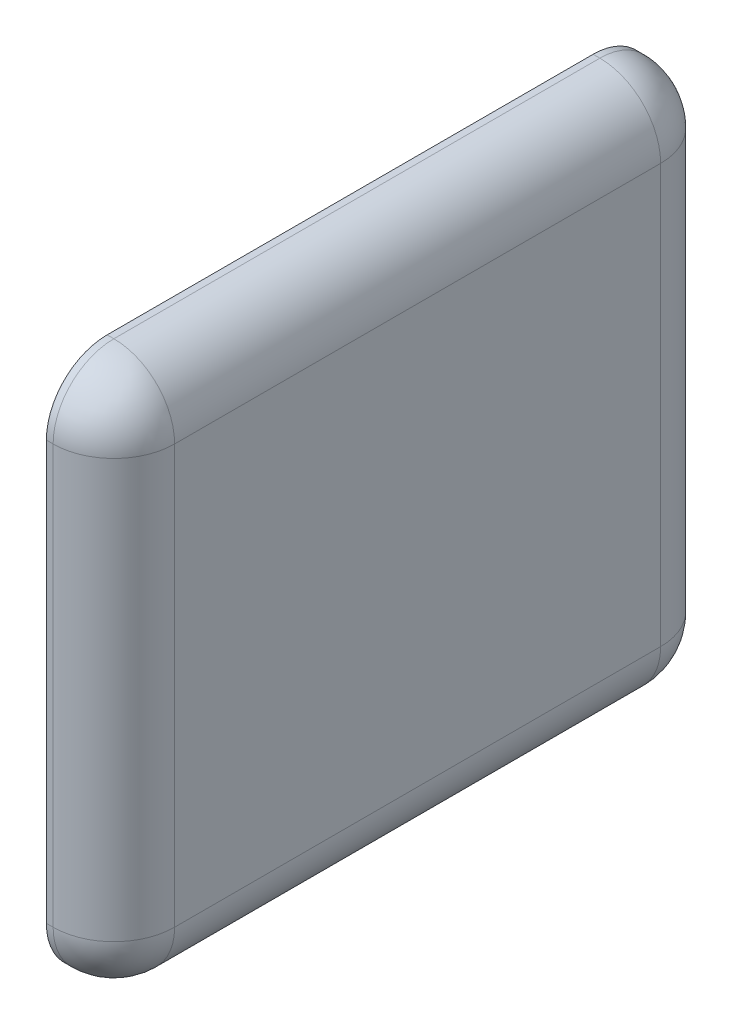
ISO-10303-21;
HEADER;
FILE_DESCRIPTION(('STEP AP214'),'2;1');
FILE_NAME('part.step','',(''),(''),'','','');
FILE_SCHEMA(('AUTOMOTIVE_DESIGN { 1 0 10303 214 1 1 1 1 }'));
ENDSEC;
DATA;
#1=APPLICATION_CONTEXT('core data for automotive mechanical design processes');
#2=APPLICATION_PROTOCOL_DEFINITION('international standard','automotive_design',2000,#1);
#3=PRODUCT_CONTEXT('',#1,'mechanical');
#4=PRODUCT('Part','Part','',(#3));
#5=PRODUCT_RELATED_PRODUCT_CATEGORY('part','',(#4));
#6=PRODUCT_DEFINITION_FORMATION('','',#4);
#7=PRODUCT_DEFINITION_CONTEXT('part definition',#1,'design');
#8=PRODUCT_DEFINITION('design','',#6,#7);
#9=PRODUCT_DEFINITION_SHAPE('','',#8);
#10=(LENGTH_UNIT() NAMED_UNIT(*) SI_UNIT(.MILLI.,.METRE.));
#11=(NAMED_UNIT(*) PLANE_ANGLE_UNIT() SI_UNIT($,.RADIAN.));
#12=(NAMED_UNIT(*) SI_UNIT($,.STERADIAN.) SOLID_ANGLE_UNIT());
#13=UNCERTAINTY_MEASURE_WITH_UNIT(LENGTH_MEASURE(1.E-05),#10,'distance_accuracy_value','');
#14=(GEOMETRIC_REPRESENTATION_CONTEXT(3) GLOBAL_UNCERTAINTY_ASSIGNED_CONTEXT((#13)) GLOBAL_UNIT_ASSIGNED_CONTEXT((#10,
#11,#12)) REPRESENTATION_CONTEXT('',''));
#15=CARTESIAN_POINT('',(0.,0.,0.));
#16=DIRECTION('',(0.,0.,1.));
#17=DIRECTION('',(1.,0.,0.));
#18=AXIS2_PLACEMENT_3D('',#15,#16,#17);
#19=CARTESIAN_POINT('',(1.4,-0.8,0.));
#20=DIRECTION('',(1.,0.,0.));
#21=DIRECTION('',(0.,0.,1.));
#22=AXIS2_PLACEMENT_3D('',#19,#20,#21);
#23=PLANE('',#22);
#24=CARTESIAN_POINT('',(1.4,-0.62,1.62));
#25=DIRECTION('',(-1.,0.,0.));
#26=DIRECTION('',(0.,-1.,0.));
#27=AXIS2_PLACEMENT_3D('',#24,#25,#26);
#28=CIRCLE('',#27,0.18);
#29=CARTESIAN_POINT('',(1.4,-0.8,1.62));
#30=VERTEX_POINT('',#29);
#31=CARTESIAN_POINT('',(1.4,-0.62,1.8));
#32=VERTEX_POINT('',#31);
#33=EDGE_CURVE('E11',#30,#32,#28,.T.);
#34=ORIENTED_EDGE('',*,*,#33,.T.);
#35=DIRECTION('',(0.,1.,0.));
#36=VECTOR('',#35,1.);
#37=CARTESIAN_POINT('',(1.4,-0.62,1.8));
#38=LINE('',#37,#36);
#39=CARTESIAN_POINT('',(1.4,0.62,1.8));
#40=VERTEX_POINT('',#39);
#41=EDGE_CURVE('E193',#32,#40,#38,.T.);
#42=ORIENTED_EDGE('',*,*,#41,.T.);
#43=CARTESIAN_POINT('',(1.4,0.62,1.62));
#44=DIRECTION('',(1.,0.,0.));
#45=DIRECTION('',(0.,1.,0.));
#46=AXIS2_PLACEMENT_3D('',#43,#44,#45);
#47=CIRCLE('',#46,0.18);
#48=CARTESIAN_POINT('',(1.4,0.8,1.62));
#49=VERTEX_POINT('',#48);
#50=EDGE_CURVE('E186',#49,#40,#47,.T.);
#51=ORIENTED_EDGE('',*,*,#50,.F.);
#52=DIRECTION('',(0.,0.,1.));
#53=VECTOR('',#52,1.);
#54=CARTESIAN_POINT('',(1.4,0.8,0.18));
#55=LINE('',#54,#53);
#56=CARTESIAN_POINT('',(1.4,0.8,0.18));
#57=VERTEX_POINT('',#56);
#58=EDGE_CURVE('E178',#57,#49,#55,.T.);
#59=ORIENTED_EDGE('',*,*,#58,.F.);
#60=CARTESIAN_POINT('',(1.4,0.62,0.18));
#61=DIRECTION('',(-1.,0.,0.));
#62=DIRECTION('',(0.,1.,0.));
#63=AXIS2_PLACEMENT_3D('',#60,#61,#62);
#64=CIRCLE('',#63,0.18);
#65=CARTESIAN_POINT('',(1.4,0.62,0.));
#66=VERTEX_POINT('',#65);
#67=EDGE_CURVE('E167',#57,#66,#64,.T.);
#68=ORIENTED_EDGE('',*,*,#67,.T.);
#69=DIRECTION('',(0.,1.,0.));
#70=VECTOR('',#69,1.);
#71=CARTESIAN_POINT('',(1.4,-0.62,0.));
#72=LINE('',#71,#70);
#73=CARTESIAN_POINT('',(1.4,-0.62,0.));
#74=VERTEX_POINT('',#73);
#75=EDGE_CURVE('E160',#74,#66,#72,.T.);
#76=ORIENTED_EDGE('',*,*,#75,.F.);
#77=CARTESIAN_POINT('',(1.4,-0.62,0.18));
#78=DIRECTION('',(1.,0.,0.));
#79=DIRECTION('',(0.,-1.,0.));
#80=AXIS2_PLACEMENT_3D('',#77,#78,#79);
#81=CIRCLE('',#80,0.18);
#82=CARTESIAN_POINT('',(1.4,-0.8,0.18));
#83=VERTEX_POINT('',#82);
#84=EDGE_CURVE('E191',#83,#74,#81,.T.);
#85=ORIENTED_EDGE('',*,*,#84,.F.);
#86=DIRECTION('',(0.,0.,1.));
#87=VECTOR('',#86,1.);
#88=CARTESIAN_POINT('',(1.4,-0.8,0.18));
#89=LINE('',#88,#87);
#90=EDGE_CURVE('E169',#83,#30,#89,.T.);
#91=ORIENTED_EDGE('',*,*,#90,.T.);
#92=EDGE_LOOP('',(#34,#42,#51,#59,#68,#76,#85,#91));
#93=FACE_BOUND('',#92,.T.);
#94=ADVANCED_FACE('F17',(#93),#23,.F.);
#95=CARTESIAN_POINT('',(1.4,-0.8,0.));
#96=DIRECTION('',(0.,1.,0.));
#97=DIRECTION('',(0.,0.,1.));
#98=AXIS2_PLACEMENT_3D('',#95,#96,#97);
#99=PLANE('',#98);
#100=DIRECTION('',(1.,0.,0.));
#101=VECTOR('',#100,1.);
#102=CARTESIAN_POINT('',(1.4,-0.8,0.18));
#103=LINE('',#102,#101);
#104=CARTESIAN_POINT('',(1.42,-0.8,0.18));
#105=VERTEX_POINT('',#104);
#106=EDGE_CURVE('E24',#83,#105,#103,.T.);
#107=ORIENTED_EDGE('',*,*,#106,.T.);
#108=DIRECTION('',(0.,0.,1.));
#109=VECTOR('',#108,1.);
#110=CARTESIAN_POINT('',(1.42,-0.8,0.18));
#111=LINE('',#110,#109);
#112=CARTESIAN_POINT('',(1.42,-0.8,1.62));
#113=VERTEX_POINT('',#112);
#114=EDGE_CURVE('E189',#105,#113,#111,.T.);
#115=ORIENTED_EDGE('',*,*,#114,.T.);
#116=DIRECTION('',(1.,0.,0.));
#117=VECTOR('',#116,1.);
#118=CARTESIAN_POINT('',(1.4,-0.8,1.62));
#119=LINE('',#118,#117);
#120=EDGE_CURVE('E183',#30,#113,#119,.T.);
#121=ORIENTED_EDGE('',*,*,#120,.F.);
#122=ORIENTED_EDGE('',*,*,#90,.F.);
#123=EDGE_LOOP('',(#107,#115,#121,#122));
#124=FACE_BOUND('',#123,.T.);
#125=ADVANCED_FACE('F231',(#124),#99,.F.);
#126=CARTESIAN_POINT('',(1.4,-0.62,0.18));
#127=DIRECTION('',(1.,0.,0.));
#128=DIRECTION('',(0.,-1.,0.));
#129=AXIS2_PLACEMENT_3D('',#126,#127,#128);
#130=CYLINDRICAL_SURFACE('',#129,0.18);
#131=ORIENTED_EDGE('',*,*,#84,.T.);
#132=DIRECTION('',(1.,0.,0.));
#133=VECTOR('',#132,1.);
#134=CARTESIAN_POINT('',(1.4,-0.62,0.));
#135=LINE('',#134,#133);
#136=CARTESIAN_POINT('',(1.42,-0.62,0.));
#137=VERTEX_POINT('',#136);
#138=EDGE_CURVE('E181',#74,#137,#135,.T.);
#139=ORIENTED_EDGE('',*,*,#138,.T.);
#140=CARTESIAN_POINT('',(1.42,-0.62,0.18));
#141=DIRECTION('',(-1.,0.,0.));
#142=DIRECTION('',(0.,0.,-1.));
#143=AXIS2_PLACEMENT_3D('',#140,#141,#142);
#144=CIRCLE('',#143,0.18);
#145=EDGE_CURVE('E171',#137,#105,#144,.T.);
#146=ORIENTED_EDGE('',*,*,#145,.T.);
#147=ORIENTED_EDGE('',*,*,#106,.F.);
#148=EDGE_LOOP('',(#131,#139,#146,#147));
#149=FACE_BOUND('',#148,.T.);
#150=ADVANCED_FACE('F224',(#149),#130,.T.);
#151=CARTESIAN_POINT('',(1.4,-0.62,1.62));
#152=DIRECTION('',(1.,0.,0.));
#153=DIRECTION('',(0.,-1.,0.));
#154=AXIS2_PLACEMENT_3D('',#151,#152,#153);
#155=CYLINDRICAL_SURFACE('',#154,0.18);
#156=ORIENTED_EDGE('',*,*,#120,.T.);
#157=CARTESIAN_POINT('',(1.42,-0.62,1.62));
#158=DIRECTION('',(1.,0.,0.));
#159=DIRECTION('',(0.,0.,1.));
#160=AXIS2_PLACEMENT_3D('',#157,#158,#159);
#161=CIRCLE('',#160,0.18);
#162=CARTESIAN_POINT('',(1.42,-0.62,1.8));
#163=VERTEX_POINT('',#162);
#164=EDGE_CURVE('E173',#163,#113,#161,.T.);
#165=ORIENTED_EDGE('',*,*,#164,.F.);
#166=DIRECTION('',(1.,0.,0.));
#167=VECTOR('',#166,1.);
#168=CARTESIAN_POINT('',(1.4,-0.62,1.8));
#169=LINE('',#168,#167);
#170=EDGE_CURVE('E163',#32,#163,#169,.T.);
#171=ORIENTED_EDGE('',*,*,#170,.F.);
#172=ORIENTED_EDGE('',*,*,#33,.F.);
#173=EDGE_LOOP('',(#156,#165,#171,#172));
#174=FACE_BOUND('',#173,.T.);
#175=ADVANCED_FACE('F233',(#174),#155,.T.);
#176=CARTESIAN_POINT('',(1.4,-0.8,0.));
#177=DIRECTION('',(0.,0.,1.));
#178=DIRECTION('',(1.,0.,0.));
#179=AXIS2_PLACEMENT_3D('',#176,#177,#178);
#180=PLANE('',#179);
#181=DIRECTION('',(1.,0.,0.));
#182=VECTOR('',#181,1.);
#183=CARTESIAN_POINT('',(1.4,0.62,0.));
#184=LINE('',#183,#182);
#185=CARTESIAN_POINT('',(1.42,0.62,0.));
#186=VERTEX_POINT('',#185);
#187=EDGE_CURVE('E176',#66,#186,#184,.T.);
#188=ORIENTED_EDGE('',*,*,#187,.T.);
#189=DIRECTION('',(0.,1.,0.));
#190=VECTOR('',#189,1.);
#191=CARTESIAN_POINT('',(1.42,-0.62,0.));
#192=LINE('',#191,#190);
#193=EDGE_CURVE('E100',#137,#186,#192,.T.);
#194=ORIENTED_EDGE('',*,*,#193,.F.);
#195=ORIENTED_EDGE('',*,*,#138,.F.);
#196=ORIENTED_EDGE('',*,*,#75,.T.);
#197=EDGE_LOOP('',(#188,#194,#195,#196));
#198=FACE_BOUND('',#197,.T.);
#199=ADVANCED_FACE('F219',(#198),#180,.F.);
#200=CARTESIAN_POINT('',(1.4,-0.8,1.8));
#201=DIRECTION('',(0.,0.,1.));
#202=DIRECTION('',(1.,0.,0.));
#203=AXIS2_PLACEMENT_3D('',#200,#201,#202);
#204=PLANE('',#203);
#205=ORIENTED_EDGE('',*,*,#41,.F.);
#206=ORIENTED_EDGE('',*,*,#170,.T.);
#207=DIRECTION('',(0.,1.,0.));
#208=VECTOR('',#207,1.);
#209=CARTESIAN_POINT('',(1.42,-0.62,1.8));
#210=LINE('',#209,#208);
#211=CARTESIAN_POINT('',(1.42,0.62,1.8));
#212=VERTEX_POINT('',#211);
#213=EDGE_CURVE('E155',#163,#212,#210,.T.);
#214=ORIENTED_EDGE('',*,*,#213,.T.);
#215=DIRECTION('',(1.,0.,0.));
#216=VECTOR('',#215,1.);
#217=CARTESIAN_POINT('',(1.4,0.62,1.8));
#218=LINE('',#217,#216);
#219=EDGE_CURVE('E152',#40,#212,#218,.T.);
#220=ORIENTED_EDGE('',*,*,#219,.F.);
#221=EDGE_LOOP('',(#205,#206,#214,#220));
#222=FACE_BOUND('',#221,.T.);
#223=ADVANCED_FACE('F201',(#222),#204,.T.);
#224=CARTESIAN_POINT('',(1.4,0.62,0.18));
#225=DIRECTION('',(1.,0.,0.));
#226=DIRECTION('',(0.,1.,0.));
#227=AXIS2_PLACEMENT_3D('',#224,#225,#226);
#228=CYLINDRICAL_SURFACE('',#227,0.18);
#229=DIRECTION('',(1.,0.,0.));
#230=VECTOR('',#229,1.);
#231=CARTESIAN_POINT('',(1.4,0.8,0.18));
#232=LINE('',#231,#230);
#233=CARTESIAN_POINT('',(1.42,0.8,0.18));
#234=VERTEX_POINT('',#233);
#235=EDGE_CURVE('E158',#57,#234,#232,.T.);
#236=ORIENTED_EDGE('',*,*,#235,.T.);
#237=CARTESIAN_POINT('',(1.42,0.62,0.18));
#238=DIRECTION('',(1.,0.,0.));
#239=DIRECTION('',(0.,0.,-1.));
#240=AXIS2_PLACEMENT_3D('',#237,#238,#239);
#241=CIRCLE('',#240,0.18);
#242=EDGE_CURVE('E122',#186,#234,#241,.T.);
#243=ORIENTED_EDGE('',*,*,#242,.F.);
#244=ORIENTED_EDGE('',*,*,#187,.F.);
#245=ORIENTED_EDGE('',*,*,#67,.F.);
#246=EDGE_LOOP('',(#236,#243,#244,#245));
#247=FACE_BOUND('',#246,.T.);
#248=ADVANCED_FACE('F217',(#247),#228,.T.);
#249=CARTESIAN_POINT('',(1.4,0.62,1.62));
#250=DIRECTION('',(1.,0.,0.));
#251=DIRECTION('',(0.,1.,0.));
#252=AXIS2_PLACEMENT_3D('',#249,#250,#251);
#253=CYLINDRICAL_SURFACE('',#252,0.18);
#254=ORIENTED_EDGE('',*,*,#50,.T.);
#255=ORIENTED_EDGE('',*,*,#219,.T.);
#256=CARTESIAN_POINT('',(1.42,0.62,1.62));
#257=DIRECTION('',(1.,0.,0.));
#258=DIRECTION('',(0.,1.,0.));
#259=AXIS2_PLACEMENT_3D('',#256,#257,#258);
#260=CIRCLE('',#259,0.18);
#261=CARTESIAN_POINT('',(1.42,0.8,1.62));
#262=VERTEX_POINT('',#261);
#263=EDGE_CURVE('E144',#262,#212,#260,.T.);
#264=ORIENTED_EDGE('',*,*,#263,.F.);
#265=DIRECTION('',(1.,0.,0.));
#266=VECTOR('',#265,1.);
#267=CARTESIAN_POINT('',(1.4,0.8,1.62));
#268=LINE('',#267,#266);
#269=EDGE_CURVE('E147',#49,#262,#268,.T.);
#270=ORIENTED_EDGE('',*,*,#269,.F.);
#271=EDGE_LOOP('',(#254,#255,#264,#270));
#272=FACE_BOUND('',#271,.T.);
#273=ADVANCED_FACE('F199',(#272),#253,.T.);
#274=CARTESIAN_POINT('',(1.4,0.8,0.));
#275=DIRECTION('',(0.,1.,0.));
#276=DIRECTION('',(0.,0.,1.));
#277=AXIS2_PLACEMENT_3D('',#274,#275,#276);
#278=PLANE('',#277);
#279=ORIENTED_EDGE('',*,*,#58,.T.);
#280=ORIENTED_EDGE('',*,*,#269,.T.);
#281=DIRECTION('',(0.,0.,1.));
#282=VECTOR('',#281,1.);
#283=CARTESIAN_POINT('',(1.42,0.8,0.18));
#284=LINE('',#283,#282);
#285=EDGE_CURVE('E139',#234,#262,#284,.T.);
#286=ORIENTED_EDGE('',*,*,#285,.F.);
#287=ORIENTED_EDGE('',*,*,#235,.F.);
#288=EDGE_LOOP('',(#279,#280,#286,#287));
#289=FACE_BOUND('',#288,.T.);
#290=ADVANCED_FACE('F212',(#289),#278,.T.);
#291=CARTESIAN_POINT('',(1.42,-0.62,0.));
#292=DIRECTION('',(0.,0.,1.));
#293=DIRECTION('',(1.,0.,0.));
#294=AXIS2_PLACEMENT_3D('',#291,#292,#293);
#295=CYLINDRICAL_SURFACE('',#294,0.18);
#296=CARTESIAN_POINT('',(1.42,-0.62,1.62));
#297=DIRECTION('',(0.,0.,-1.));
#298=DIRECTION('',(1.,0.,0.));
#299=AXIS2_PLACEMENT_3D('',#296,#297,#298);
#300=CIRCLE('',#299,0.18);
#301=CARTESIAN_POINT('',(1.6,-0.62,1.62));
#302=VERTEX_POINT('',#301);
#303=EDGE_CURVE('E149',#302,#113,#300,.T.);
#304=ORIENTED_EDGE('',*,*,#303,.T.);
#305=ORIENTED_EDGE('',*,*,#114,.F.);
#306=CARTESIAN_POINT('',(1.42,-0.62,0.18));
#307=DIRECTION('',(0.,0.,-1.));
#308=DIRECTION('',(1.,0.,0.));
#309=AXIS2_PLACEMENT_3D('',#306,#307,#308);
#310=CIRCLE('',#309,0.18);
#311=CARTESIAN_POINT('',(1.6,-0.62,0.18));
#312=VERTEX_POINT('',#311);
#313=EDGE_CURVE('E141',#312,#105,#310,.T.);
#314=ORIENTED_EDGE('',*,*,#313,.F.);
#315=DIRECTION('',(0.,0.,1.));
#316=VECTOR('',#315,1.);
#317=CARTESIAN_POINT('',(1.6,-0.62,0.18));
#318=LINE('',#317,#316);
#319=EDGE_CURVE('E125',#312,#302,#318,.T.);
#320=ORIENTED_EDGE('',*,*,#319,.T.);
#321=EDGE_LOOP('',(#304,#305,#314,#320));
#322=FACE_BOUND('',#321,.T.);
#323=ADVANCED_FACE('F229',(#322),#295,.T.);
#324=CARTESIAN_POINT('',(1.42,-0.62,0.18));
#325=DIRECTION('',(0.,0.,1.));
#326=DIRECTION('',(1.,0.,0.));
#327=AXIS2_PLACEMENT_3D('',#324,#325,#326);
#328=SPHERICAL_SURFACE('',#327,0.18);
#329=ORIENTED_EDGE('',*,*,#313,.T.);
#330=ORIENTED_EDGE('',*,*,#145,.F.);
#331=CARTESIAN_POINT('',(1.42,-0.62,0.18));
#332=DIRECTION('',(0.,-1.,0.));
#333=DIRECTION('',(0.,0.,-1.));
#334=AXIS2_PLACEMENT_3D('',#331,#332,#333);
#335=CIRCLE('',#334,0.18);
#336=EDGE_CURVE('E133',#137,#312,#335,.T.);
#337=ORIENTED_EDGE('',*,*,#336,.T.);
#338=EDGE_LOOP('',(#329,#330,#337));
#339=FACE_BOUND('',#338,.T.);
#340=ADVANCED_FACE('F227',(#339),#328,.T.);
#341=CARTESIAN_POINT('',(1.42,-0.62,1.62));
#342=DIRECTION('',(0.,0.,-1.));
#343=DIRECTION('',(1.,0.,0.));
#344=AXIS2_PLACEMENT_3D('',#341,#342,#343);
#345=SPHERICAL_SURFACE('',#344,0.18);
#346=CARTESIAN_POINT('',(1.42,-0.62,1.62));
#347=DIRECTION('',(0.,1.,0.));
#348=DIRECTION('',(0.,0.,1.));
#349=AXIS2_PLACEMENT_3D('',#346,#347,#348);
#350=CIRCLE('',#349,0.18);
#351=EDGE_CURVE('E136',#163,#302,#350,.T.);
#352=ORIENTED_EDGE('',*,*,#351,.F.);
#353=ORIENTED_EDGE('',*,*,#164,.T.);
#354=ORIENTED_EDGE('',*,*,#303,.F.);
#355=EDGE_LOOP('',(#352,#353,#354));
#356=FACE_BOUND('',#355,.T.);
#357=ADVANCED_FACE('F235',(#356),#345,.T.);
#358=CARTESIAN_POINT('',(1.42,-0.8,0.18));
#359=DIRECTION('',(0.,1.,0.));
#360=DIRECTION('',(1.,0.,0.));
#361=AXIS2_PLACEMENT_3D('',#358,#359,#360);
#362=CYLINDRICAL_SURFACE('',#361,0.18);
#363=ORIENTED_EDGE('',*,*,#336,.F.);
#364=ORIENTED_EDGE('',*,*,#193,.T.);
#365=CARTESIAN_POINT('',(1.42,0.62,0.18));
#366=DIRECTION('',(0.,-1.,0.));
#367=DIRECTION('',(0.,0.,-1.));
#368=AXIS2_PLACEMENT_3D('',#365,#366,#367);
#369=CIRCLE('',#368,0.18);
#370=CARTESIAN_POINT('',(1.6,0.62,0.18));
#371=VERTEX_POINT('',#370);
#372=EDGE_CURVE('E92',#186,#371,#369,.T.);
#373=ORIENTED_EDGE('',*,*,#372,.T.);
#374=DIRECTION('',(0.,1.,0.));
#375=VECTOR('',#374,1.);
#376=CARTESIAN_POINT('',(1.6,-0.62,0.18));
#377=LINE('',#376,#375);
#378=EDGE_CURVE('E97',#312,#371,#377,.T.);
#379=ORIENTED_EDGE('',*,*,#378,.F.);
#380=EDGE_LOOP('',(#363,#364,#373,#379));
#381=FACE_BOUND('',#380,.T.);
#382=ADVANCED_FACE('F95',(#381),#362,.T.);
#383=CARTESIAN_POINT('',(1.42,-0.8,1.62));
#384=DIRECTION('',(0.,1.,0.));
#385=DIRECTION('',(1.,0.,0.));
#386=AXIS2_PLACEMENT_3D('',#383,#384,#385);
#387=CYLINDRICAL_SURFACE('',#386,0.18);
#388=DIRECTION('',(0.,1.,0.));
#389=VECTOR('',#388,1.);
#390=CARTESIAN_POINT('',(1.6,-0.62,1.62));
#391=LINE('',#390,#389);
#392=CARTESIAN_POINT('',(1.6,0.62,1.62));
#393=VERTEX_POINT('',#392);
#394=EDGE_CURVE('E104',#302,#393,#391,.T.);
#395=ORIENTED_EDGE('',*,*,#394,.T.);
#396=CARTESIAN_POINT('',(1.42,0.62,1.62));
#397=DIRECTION('',(0.,-1.,0.));
#398=DIRECTION('',(1.,0.,0.));
#399=AXIS2_PLACEMENT_3D('',#396,#397,#398);
#400=CIRCLE('',#399,0.18);
#401=EDGE_CURVE('E105',#393,#212,#400,.T.);
#402=ORIENTED_EDGE('',*,*,#401,.T.);
#403=ORIENTED_EDGE('',*,*,#213,.F.);
#404=ORIENTED_EDGE('',*,*,#351,.T.);
#405=EDGE_LOOP('',(#395,#402,#403,#404));
#406=FACE_BOUND('',#405,.T.);
#407=ADVANCED_FACE('F205',(#406),#387,.T.);
#408=CARTESIAN_POINT('',(1.42,0.62,0.18));
#409=DIRECTION('',(0.,0.,1.));
#410=DIRECTION('',(1.,0.,0.));
#411=AXIS2_PLACEMENT_3D('',#408,#409,#410);
#412=SPHERICAL_SURFACE('',#411,0.18);
#413=ORIENTED_EDGE('',*,*,#372,.F.);
#414=ORIENTED_EDGE('',*,*,#242,.T.);
#415=CARTESIAN_POINT('',(1.42,0.62,0.18));
#416=DIRECTION('',(0.,0.,1.));
#417=DIRECTION('',(1.,0.,0.));
#418=AXIS2_PLACEMENT_3D('',#415,#416,#417);
#419=CIRCLE('',#418,0.18);
#420=EDGE_CURVE('E114',#371,#234,#419,.T.);
#421=ORIENTED_EDGE('',*,*,#420,.F.);
#422=EDGE_LOOP('',(#413,#414,#421));
#423=FACE_BOUND('',#422,.T.);
#424=ADVANCED_FACE('F120',(#423),#412,.T.);
#425=CARTESIAN_POINT('',(1.42,0.62,1.62));
#426=DIRECTION('',(0.,-1.,0.));
#427=DIRECTION('',(1.,0.,0.));
#428=AXIS2_PLACEMENT_3D('',#425,#426,#427);
#429=SPHERICAL_SURFACE('',#428,0.18);
#430=CARTESIAN_POINT('',(1.42,0.62,1.62));
#431=DIRECTION('',(0.,0.,-1.));
#432=DIRECTION('',(0.,1.,0.));
#433=AXIS2_PLACEMENT_3D('',#430,#431,#432);
#434=CIRCLE('',#433,0.18);
#435=EDGE_CURVE('E116',#262,#393,#434,.T.);
#436=ORIENTED_EDGE('',*,*,#435,.F.);
#437=ORIENTED_EDGE('',*,*,#263,.T.);
#438=ORIENTED_EDGE('',*,*,#401,.F.);
#439=EDGE_LOOP('',(#436,#437,#438));
#440=FACE_BOUND('',#439,.T.);
#441=ADVANCED_FACE('F208',(#440),#429,.T.);
#442=CARTESIAN_POINT('',(1.42,0.62,0.));
#443=DIRECTION('',(0.,0.,1.));
#444=DIRECTION('',(1.,0.,0.));
#445=AXIS2_PLACEMENT_3D('',#442,#443,#444);
#446=CYLINDRICAL_SURFACE('',#445,0.18);
#447=DIRECTION('',(0.,0.,1.));
#448=VECTOR('',#447,1.);
#449=CARTESIAN_POINT('',(1.6,0.62,0.18));
#450=LINE('',#449,#448);
#451=EDGE_CURVE('E111',#371,#393,#450,.T.);
#452=ORIENTED_EDGE('',*,*,#451,.F.);
#453=ORIENTED_EDGE('',*,*,#420,.T.);
#454=ORIENTED_EDGE('',*,*,#285,.T.);
#455=ORIENTED_EDGE('',*,*,#435,.T.);
#456=EDGE_LOOP('',(#452,#453,#454,#455));
#457=FACE_BOUND('',#456,.T.);
#458=ADVANCED_FACE('F112',(#457),#446,.T.);
#459=CARTESIAN_POINT('',(1.6,-0.8,0.));
#460=DIRECTION('',(1.,0.,0.));
#461=DIRECTION('',(0.,0.,1.));
#462=AXIS2_PLACEMENT_3D('',#459,#460,#461);
#463=PLANE('',#462);
#464=ORIENTED_EDGE('',*,*,#319,.F.);
#465=ORIENTED_EDGE('',*,*,#378,.T.);
#466=ORIENTED_EDGE('',*,*,#451,.T.);
#467=ORIENTED_EDGE('',*,*,#394,.F.);
#468=EDGE_LOOP('',(#464,#465,#466,#467));
#469=FACE_BOUND('',#468,.T.);
#470=ADVANCED_FACE('F124',(#469),#463,.T.);
#471=CLOSED_SHELL('',(#94,#125,#150,#175,#199,#223,#248,#273,#290,#323,#340,#357,#382,#407,#424,
#441,#458,#470));
#472=MANIFOLD_SOLID_BREP('B1',#471);
#473=ADVANCED_BREP_SHAPE_REPRESENTATION('',(#18,#472),#14);
#474=SHAPE_DEFINITION_REPRESENTATION(#9,#473);
ENDSEC;
END-ISO-10303-21;
